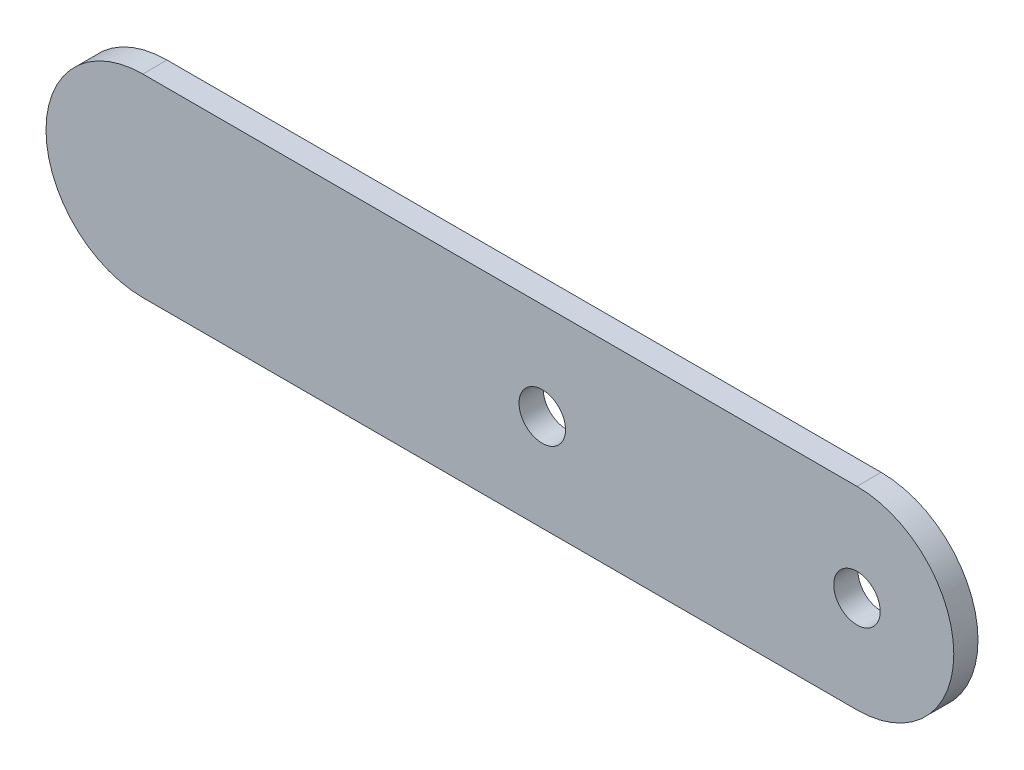
ISO-10303-21;
HEADER;
FILE_DESCRIPTION(('STEP AP214'),'2;1');
FILE_NAME('part.step','',(''),(''),'','','');
FILE_SCHEMA(('AUTOMOTIVE_DESIGN { 1 0 10303 214 1 1 1 1 }'));
ENDSEC;
DATA;
#1=APPLICATION_CONTEXT('core data for automotive mechanical design processes');
#2=APPLICATION_PROTOCOL_DEFINITION('international standard','automotive_design',2000,#1);
#3=PRODUCT_CONTEXT('',#1,'mechanical');
#4=PRODUCT('Part','Part','',(#3));
#5=PRODUCT_RELATED_PRODUCT_CATEGORY('part','',(#4));
#6=PRODUCT_DEFINITION_FORMATION('','',#4);
#7=PRODUCT_DEFINITION_CONTEXT('part definition',#1,'design');
#8=PRODUCT_DEFINITION('design','',#6,#7);
#9=PRODUCT_DEFINITION_SHAPE('','',#8);
#10=(LENGTH_UNIT() NAMED_UNIT(*) SI_UNIT(.MILLI.,.METRE.));
#11=(NAMED_UNIT(*) PLANE_ANGLE_UNIT() SI_UNIT($,.RADIAN.));
#12=(NAMED_UNIT(*) SI_UNIT($,.STERADIAN.) SOLID_ANGLE_UNIT());
#13=UNCERTAINTY_MEASURE_WITH_UNIT(LENGTH_MEASURE(1.E-05),#10,'distance_accuracy_value','');
#14=(GEOMETRIC_REPRESENTATION_CONTEXT(3) GLOBAL_UNCERTAINTY_ASSIGNED_CONTEXT((#13)) GLOBAL_UNIT_ASSIGNED_CONTEXT((#10,
#11,#12)) REPRESENTATION_CONTEXT('',''));
#15=CARTESIAN_POINT('',(0.,0.,0.));
#16=DIRECTION('',(0.,0.,1.));
#17=DIRECTION('',(1.,0.,0.));
#18=AXIS2_PLACEMENT_3D('',#15,#16,#17);
#19=CARTESIAN_POINT('',(46.83125,0.,3.175));
#20=DIRECTION('',(0.,0.,1.));
#21=DIRECTION('',(1.,0.,0.));
#22=AXIS2_PLACEMENT_3D('',#19,#20,#21);
#23=PLANE('',#22);
#24=CARTESIAN_POINT('',(46.83125,0.,3.175));
#25=DIRECTION('',(0.,0.,1.));
#26=DIRECTION('',(1.,0.,0.));
#27=AXIS2_PLACEMENT_3D('',#24,#25,#26);
#28=CIRCLE('',#27,3.048);
#29=CARTESIAN_POINT('',(49.87925,0.,3.175));
#30=VERTEX_POINT('',#29);
#31=EDGE_CURVE('E101',#30,#30,#28,.T.);
#32=ORIENTED_EDGE('',*,*,#31,.F.);
#33=EDGE_LOOP('',(#32));
#34=FACE_BOUND('',#33,.T.);
#35=CARTESIAN_POINT('',(46.83125,0.,3.175));
#36=DIRECTION('',(0.,0.,1.));
#37=DIRECTION('',(1.,0.,0.));
#38=AXIS2_PLACEMENT_3D('',#35,#36,#37);
#39=CIRCLE('',#38,12.7);
#40=CARTESIAN_POINT('',(46.83125,-12.7,3.175));
#41=VERTEX_POINT('',#40);
#42=CARTESIAN_POINT('',(46.83125,12.7,3.175));
#43=VERTEX_POINT('',#42);
#44=EDGE_CURVE('E86',#41,#43,#39,.T.);
#45=ORIENTED_EDGE('',*,*,#44,.T.);
#46=DIRECTION('',(-1.,0.,0.));
#47=VECTOR('',#46,1.);
#48=CARTESIAN_POINT('',(-46.83125,12.7,3.175));
#49=LINE('',#48,#47);
#50=CARTESIAN_POINT('',(-46.83125,12.7,3.175));
#51=VERTEX_POINT('',#50);
#52=EDGE_CURVE('E81',#43,#51,#49,.T.);
#53=ORIENTED_EDGE('',*,*,#52,.T.);
#54=CARTESIAN_POINT('',(-46.83125,0.,3.175));
#55=DIRECTION('',(0.,0.,1.));
#56=DIRECTION('',(1.,0.,0.));
#57=AXIS2_PLACEMENT_3D('',#54,#55,#56);
#58=CIRCLE('',#57,12.7);
#59=CARTESIAN_POINT('',(-46.83125,-12.7,3.175));
#60=VERTEX_POINT('',#59);
#61=EDGE_CURVE('E84',#51,#60,#58,.T.);
#62=ORIENTED_EDGE('',*,*,#61,.T.);
#63=DIRECTION('',(1.,0.,0.));
#64=VECTOR('',#63,1.);
#65=CARTESIAN_POINT('',(-46.83125,-12.7,3.175));
#66=LINE('',#65,#64);
#67=EDGE_CURVE('E51',#60,#41,#66,.T.);
#68=ORIENTED_EDGE('',*,*,#67,.T.);
#69=EDGE_LOOP('',(#45,#53,#62,#68));
#70=FACE_BOUND('',#69,.T.);
#71=CARTESIAN_POINT('',(5.55625000000003,0.,3.175));
#72=DIRECTION('',(0.,0.,1.));
#73=DIRECTION('',(1.,0.,0.));
#74=AXIS2_PLACEMENT_3D('',#71,#72,#73);
#75=CIRCLE('',#74,3.048);
#76=CARTESIAN_POINT('',(8.60425000000003,0.,3.175));
#77=VERTEX_POINT('',#76);
#78=EDGE_CURVE('E116',#77,#77,#75,.T.);
#79=ORIENTED_EDGE('',*,*,#78,.F.);
#80=EDGE_LOOP('',(#79));
#81=FACE_BOUND('',#80,.T.);
#82=ADVANCED_FACE('F34',(#34,#70,#81),#23,.T.);
#83=CARTESIAN_POINT('',(46.83125,0.,0.));
#84=DIRECTION('',(0.,0.,1.));
#85=DIRECTION('',(1.,0.,0.));
#86=AXIS2_PLACEMENT_3D('',#83,#84,#85);
#87=PLANE('',#86);
#88=CARTESIAN_POINT('',(46.83125,0.,0.));
#89=DIRECTION('',(0.,0.,1.));
#90=DIRECTION('',(1.,0.,0.));
#91=AXIS2_PLACEMENT_3D('',#88,#89,#90);
#92=CIRCLE('',#91,12.7);
#93=CARTESIAN_POINT('',(46.83125,-12.7,0.));
#94=VERTEX_POINT('',#93);
#95=CARTESIAN_POINT('',(46.83125,12.7,0.));
#96=VERTEX_POINT('',#95);
#97=EDGE_CURVE('E98',#94,#96,#92,.T.);
#98=ORIENTED_EDGE('',*,*,#97,.F.);
#99=DIRECTION('',(1.,0.,0.));
#100=VECTOR('',#99,1.);
#101=CARTESIAN_POINT('',(-46.83125,-12.7,0.));
#102=LINE('',#101,#100);
#103=CARTESIAN_POINT('',(-46.83125,-12.7,0.));
#104=VERTEX_POINT('',#103);
#105=EDGE_CURVE('E74',#104,#94,#102,.T.);
#106=ORIENTED_EDGE('',*,*,#105,.F.);
#107=CARTESIAN_POINT('',(-46.83125,0.,0.));
#108=DIRECTION('',(0.,0.,1.));
#109=DIRECTION('',(1.,0.,0.));
#110=AXIS2_PLACEMENT_3D('',#107,#108,#109);
#111=CIRCLE('',#110,12.7);
#112=CARTESIAN_POINT('',(-46.83125,12.7,0.));
#113=VERTEX_POINT('',#112);
#114=EDGE_CURVE('E68',#113,#104,#111,.T.);
#115=ORIENTED_EDGE('',*,*,#114,.F.);
#116=DIRECTION('',(-1.,0.,0.));
#117=VECTOR('',#116,1.);
#118=CARTESIAN_POINT('',(-46.83125,12.7,0.));
#119=LINE('',#118,#117);
#120=EDGE_CURVE('E90',#96,#113,#119,.T.);
#121=ORIENTED_EDGE('',*,*,#120,.F.);
#122=EDGE_LOOP('',(#98,#106,#115,#121));
#123=FACE_BOUND('',#122,.T.);
#124=CARTESIAN_POINT('',(46.83125,0.,0.));
#125=DIRECTION('',(0.,0.,1.));
#126=DIRECTION('',(1.,0.,0.));
#127=AXIS2_PLACEMENT_3D('',#124,#125,#126);
#128=CIRCLE('',#127,3.048);
#129=CARTESIAN_POINT('',(49.87925,0.,0.));
#130=VERTEX_POINT('',#129);
#131=EDGE_CURVE('E113',#130,#130,#128,.T.);
#132=ORIENTED_EDGE('',*,*,#131,.T.);
#133=EDGE_LOOP('',(#132));
#134=FACE_BOUND('',#133,.T.);
#135=CARTESIAN_POINT('',(5.55625000000003,0.,0.));
#136=DIRECTION('',(0.,0.,1.));
#137=DIRECTION('',(1.,0.,0.));
#138=AXIS2_PLACEMENT_3D('',#135,#136,#137);
#139=CIRCLE('',#138,3.048);
#140=CARTESIAN_POINT('',(8.60425000000003,0.,0.));
#141=VERTEX_POINT('',#140);
#142=EDGE_CURVE('E119',#141,#141,#139,.T.);
#143=ORIENTED_EDGE('',*,*,#142,.T.);
#144=EDGE_LOOP('',(#143));
#145=FACE_BOUND('',#144,.T.);
#146=ADVANCED_FACE('F109',(#123,#134,#145),#87,.F.);
#147=CARTESIAN_POINT('',(46.83125,0.,3.175));
#148=DIRECTION('',(0.,0.,-1.));
#149=DIRECTION('',(-1.,0.,0.));
#150=AXIS2_PLACEMENT_3D('',#147,#148,#149);
#151=CYLINDRICAL_SURFACE('',#150,12.7);
#152=ORIENTED_EDGE('',*,*,#97,.T.);
#153=DIRECTION('',(0.,0.,-1.));
#154=VECTOR('',#153,1.);
#155=CARTESIAN_POINT('',(46.83125,12.7,3.175));
#156=LINE('',#155,#154);
#157=EDGE_CURVE('E11',#43,#96,#156,.T.);
#158=ORIENTED_EDGE('',*,*,#157,.F.);
#159=ORIENTED_EDGE('',*,*,#44,.F.);
#160=DIRECTION('',(0.,0.,-1.));
#161=VECTOR('',#160,1.);
#162=CARTESIAN_POINT('',(46.83125,-12.7,3.175));
#163=LINE('',#162,#161);
#164=EDGE_CURVE('E94',#41,#94,#163,.T.);
#165=ORIENTED_EDGE('',*,*,#164,.T.);
#166=EDGE_LOOP('',(#152,#158,#159,#165));
#167=FACE_BOUND('',#166,.T.);
#168=ADVANCED_FACE('F36',(#167),#151,.T.);
#169=CARTESIAN_POINT('',(-46.83125,12.7,3.175));
#170=DIRECTION('',(0.,-1.,0.));
#171=DIRECTION('',(1.,0.,0.));
#172=AXIS2_PLACEMENT_3D('',#169,#170,#171);
#173=PLANE('',#172);
#174=ORIENTED_EDGE('',*,*,#120,.T.);
#175=DIRECTION('',(0.,0.,-1.));
#176=VECTOR('',#175,1.);
#177=CARTESIAN_POINT('',(-46.83125,12.7,3.175));
#178=LINE('',#177,#176);
#179=EDGE_CURVE('E43',#51,#113,#178,.T.);
#180=ORIENTED_EDGE('',*,*,#179,.F.);
#181=ORIENTED_EDGE('',*,*,#52,.F.);
#182=ORIENTED_EDGE('',*,*,#157,.T.);
#183=EDGE_LOOP('',(#174,#180,#181,#182));
#184=FACE_BOUND('',#183,.T.);
#185=ADVANCED_FACE('F89',(#184),#173,.F.);
#186=CARTESIAN_POINT('',(-46.83125,0.,3.175));
#187=DIRECTION('',(0.,0.,-1.));
#188=DIRECTION('',(-1.,0.,0.));
#189=AXIS2_PLACEMENT_3D('',#186,#187,#188);
#190=CYLINDRICAL_SURFACE('',#189,12.7);
#191=ORIENTED_EDGE('',*,*,#114,.T.);
#192=DIRECTION('',(0.,0.,-1.));
#193=VECTOR('',#192,1.);
#194=CARTESIAN_POINT('',(-46.83125,-12.7,3.175));
#195=LINE('',#194,#193);
#196=EDGE_CURVE('E91',#60,#104,#195,.T.);
#197=ORIENTED_EDGE('',*,*,#196,.F.);
#198=ORIENTED_EDGE('',*,*,#61,.F.);
#199=ORIENTED_EDGE('',*,*,#179,.T.);
#200=EDGE_LOOP('',(#191,#197,#198,#199));
#201=FACE_BOUND('',#200,.T.);
#202=ADVANCED_FACE('F92',(#201),#190,.T.);
#203=CARTESIAN_POINT('',(-46.83125,-12.7,3.175));
#204=DIRECTION('',(0.,1.,0.));
#205=DIRECTION('',(0.,0.,1.));
#206=AXIS2_PLACEMENT_3D('',#203,#204,#205);
#207=PLANE('',#206);
#208=ORIENTED_EDGE('',*,*,#105,.T.);
#209=ORIENTED_EDGE('',*,*,#164,.F.);
#210=ORIENTED_EDGE('',*,*,#67,.F.);
#211=ORIENTED_EDGE('',*,*,#196,.T.);
#212=EDGE_LOOP('',(#208,#209,#210,#211));
#213=FACE_BOUND('',#212,.T.);
#214=ADVANCED_FACE('F106',(#213),#207,.F.);
#215=CARTESIAN_POINT('',(46.83125,0.,3.175));
#216=DIRECTION('',(0.,0.,-1.));
#217=DIRECTION('',(-1.,0.,0.));
#218=AXIS2_PLACEMENT_3D('',#215,#216,#217);
#219=CYLINDRICAL_SURFACE('',#218,3.048);
#220=ORIENTED_EDGE('',*,*,#31,.T.);
#221=EDGE_LOOP('',(#220));
#222=FACE_BOUND('',#221,.T.);
#223=ORIENTED_EDGE('',*,*,#131,.F.);
#224=EDGE_LOOP('',(#223));
#225=FACE_BOUND('',#224,.T.);
#226=ADVANCED_FACE('F136',(#222,#225),#219,.F.);
#227=CARTESIAN_POINT('',(5.55625000000003,0.,3.175));
#228=DIRECTION('',(0.,0.,-1.));
#229=DIRECTION('',(-1.,0.,0.));
#230=AXIS2_PLACEMENT_3D('',#227,#228,#229);
#231=CYLINDRICAL_SURFACE('',#230,3.048);
#232=ORIENTED_EDGE('',*,*,#78,.T.);
#233=EDGE_LOOP('',(#232));
#234=FACE_BOUND('',#233,.T.);
#235=ORIENTED_EDGE('',*,*,#142,.F.);
#236=EDGE_LOOP('',(#235));
#237=FACE_BOUND('',#236,.T.);
#238=ADVANCED_FACE('F125',(#234,#237),#231,.F.);
#239=CLOSED_SHELL('',(#82,#146,#168,#185,#202,#214,#226,#238));
#240=MANIFOLD_SOLID_BREP('B2',#239);
#241=ADVANCED_BREP_SHAPE_REPRESENTATION('',(#18,#240),#14);
#242=SHAPE_DEFINITION_REPRESENTATION(#9,#241);
ENDSEC;
END-ISO-10303-21;
